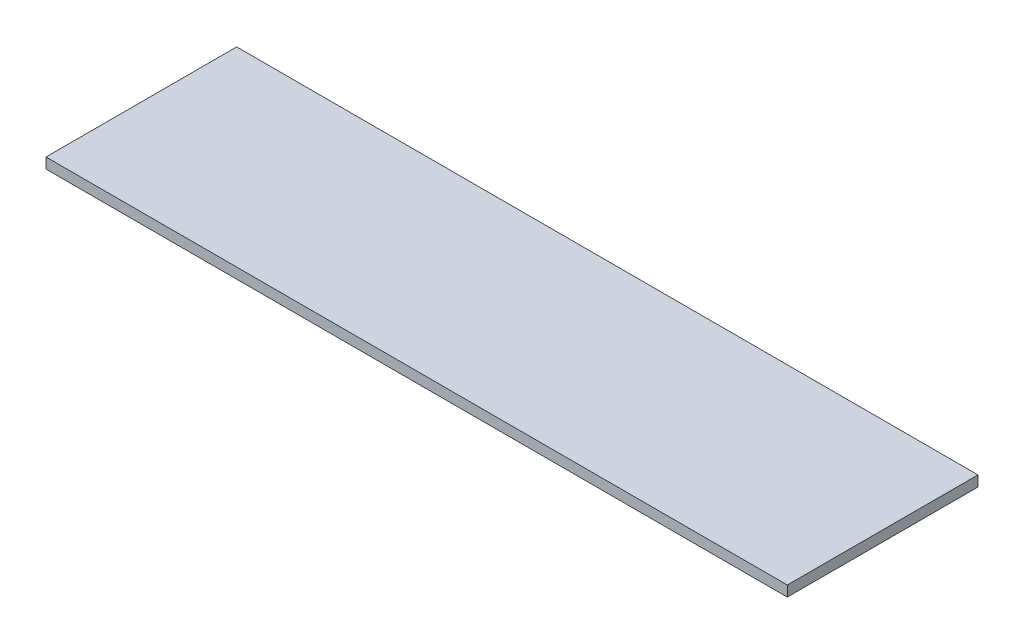
ISO-10303-21;
HEADER;
FILE_DESCRIPTION(('STEP AP214'),'2;1');
FILE_NAME('part.step','',(''),(''),'','','');
FILE_SCHEMA(('AUTOMOTIVE_DESIGN { 1 0 10303 214 1 1 1 1 }'));
ENDSEC;
DATA;
#1=APPLICATION_CONTEXT('core data for automotive mechanical design processes');
#2=APPLICATION_PROTOCOL_DEFINITION('international standard','automotive_design',2000,#1);
#3=PRODUCT_CONTEXT('',#1,'mechanical');
#4=PRODUCT('Part','Part','',(#3));
#5=PRODUCT_RELATED_PRODUCT_CATEGORY('part','',(#4));
#6=PRODUCT_DEFINITION_FORMATION('','',#4);
#7=PRODUCT_DEFINITION_CONTEXT('part definition',#1,'design');
#8=PRODUCT_DEFINITION('design','',#6,#7);
#9=PRODUCT_DEFINITION_SHAPE('','',#8);
#10=(LENGTH_UNIT() NAMED_UNIT(*) SI_UNIT(.MILLI.,.METRE.));
#11=(NAMED_UNIT(*) PLANE_ANGLE_UNIT() SI_UNIT($,.RADIAN.));
#12=(NAMED_UNIT(*) SI_UNIT($,.STERADIAN.) SOLID_ANGLE_UNIT());
#13=UNCERTAINTY_MEASURE_WITH_UNIT(LENGTH_MEASURE(1.E-05),#10,'distance_accuracy_value','');
#14=(GEOMETRIC_REPRESENTATION_CONTEXT(3) GLOBAL_UNCERTAINTY_ASSIGNED_CONTEXT((#13)) GLOBAL_UNIT_ASSIGNED_CONTEXT((#10,
#11,#12)) REPRESENTATION_CONTEXT('',''));
#15=CARTESIAN_POINT('',(0.,0.,0.));
#16=DIRECTION('',(0.,0.,1.));
#17=DIRECTION('',(1.,0.,0.));
#18=AXIS2_PLACEMENT_3D('',#15,#16,#17);
#19=CARTESIAN_POINT('',(0.,2.,-36.3076427679414));
#20=DIRECTION('',(1.,0.,0.));
#21=DIRECTION('',(0.,0.,-1.));
#22=AXIS2_PLACEMENT_3D('',#19,#20,#21);
#23=PLANE('',#22);
#24=DIRECTION('',(0.,0.,1.));
#25=VECTOR('',#24,1.);
#26=CARTESIAN_POINT('',(0.,0.,-36.3076427679414));
#27=LINE('',#26,#25);
#28=CARTESIAN_POINT('',(0.,0.,-36.3076427679414));
#29=VERTEX_POINT('',#28);
#30=CARTESIAN_POINT('',(0.,0.,0.));
#31=VERTEX_POINT('',#30);
#32=EDGE_CURVE('E107',#29,#31,#27,.T.);
#33=ORIENTED_EDGE('',*,*,#32,.T.);
#34=DIRECTION('',(0.,-1.,0.));
#35=VECTOR('',#34,1.);
#36=CARTESIAN_POINT('',(0.,2.,0.));
#37=LINE('',#36,#35);
#38=CARTESIAN_POINT('',(0.,2.,0.));
#39=VERTEX_POINT('',#38);
#40=EDGE_CURVE('E11',#39,#31,#37,.T.);
#41=ORIENTED_EDGE('',*,*,#40,.F.);
#42=DIRECTION('',(0.,0.,1.));
#43=VECTOR('',#42,1.);
#44=CARTESIAN_POINT('',(0.,2.,-36.3076427679414));
#45=LINE('',#44,#43);
#46=CARTESIAN_POINT('',(0.,2.,-36.3076427679414));
#47=VERTEX_POINT('',#46);
#48=EDGE_CURVE('E91',#47,#39,#45,.T.);
#49=ORIENTED_EDGE('',*,*,#48,.F.);
#50=DIRECTION('',(0.,-1.,0.));
#51=VECTOR('',#50,1.);
#52=CARTESIAN_POINT('',(0.,2.,-36.3076427679414));
#53=LINE('',#52,#51);
#54=EDGE_CURVE('E103',#47,#29,#53,.T.);
#55=ORIENTED_EDGE('',*,*,#54,.T.);
#56=EDGE_LOOP('',(#33,#41,#49,#55));
#57=FACE_BOUND('',#56,.T.);
#58=ADVANCED_FACE('F39',(#57),#23,.F.);
#59=CARTESIAN_POINT('',(0.,2.,0.));
#60=DIRECTION('',(0.,0.,-1.));
#61=DIRECTION('',(-1.,0.,0.));
#62=AXIS2_PLACEMENT_3D('',#59,#60,#61);
#63=PLANE('',#62);
#64=DIRECTION('',(1.,0.,0.));
#65=VECTOR('',#64,1.);
#66=CARTESIAN_POINT('',(0.,0.,0.));
#67=LINE('',#66,#65);
#68=CARTESIAN_POINT('',(141.16131970371,0.,0.));
#69=VERTEX_POINT('',#68);
#70=EDGE_CURVE('E96',#31,#69,#67,.T.);
#71=ORIENTED_EDGE('',*,*,#70,.T.);
#72=DIRECTION('',(0.,-1.,0.));
#73=VECTOR('',#72,1.);
#74=CARTESIAN_POINT('',(141.16131970371,2.,0.));
#75=LINE('',#74,#73);
#76=CARTESIAN_POINT('',(141.16131970371,2.,0.));
#77=VERTEX_POINT('',#76);
#78=EDGE_CURVE('E48',#77,#69,#75,.T.);
#79=ORIENTED_EDGE('',*,*,#78,.F.);
#80=DIRECTION('',(1.,0.,0.));
#81=VECTOR('',#80,1.);
#82=CARTESIAN_POINT('',(0.,2.,0.));
#83=LINE('',#82,#81);
#84=EDGE_CURVE('E86',#39,#77,#83,.T.);
#85=ORIENTED_EDGE('',*,*,#84,.F.);
#86=ORIENTED_EDGE('',*,*,#40,.T.);
#87=EDGE_LOOP('',(#71,#79,#85,#86));
#88=FACE_BOUND('',#87,.T.);
#89=ADVANCED_FACE('F95',(#88),#63,.F.);
#90=CARTESIAN_POINT('',(141.16131970371,2.,0.));
#91=DIRECTION('',(-1.,0.,0.));
#92=DIRECTION('',(0.,0.,1.));
#93=AXIS2_PLACEMENT_3D('',#90,#91,#92);
#94=PLANE('',#93);
#95=DIRECTION('',(0.,0.,-1.));
#96=VECTOR('',#95,1.);
#97=CARTESIAN_POINT('',(141.16131970371,0.,0.));
#98=LINE('',#97,#96);
#99=CARTESIAN_POINT('',(141.16131970371,0.,-36.3076427679414));
#100=VERTEX_POINT('',#99);
#101=EDGE_CURVE('E73',#69,#100,#98,.T.);
#102=ORIENTED_EDGE('',*,*,#101,.T.);
#103=DIRECTION('',(0.,-1.,0.));
#104=VECTOR('',#103,1.);
#105=CARTESIAN_POINT('',(141.16131970371,2.,-36.3076427679414));
#106=LINE('',#105,#104);
#107=CARTESIAN_POINT('',(141.16131970371,2.,-36.3076427679414));
#108=VERTEX_POINT('',#107);
#109=EDGE_CURVE('E98',#108,#100,#106,.T.);
#110=ORIENTED_EDGE('',*,*,#109,.F.);
#111=DIRECTION('',(0.,0.,-1.));
#112=VECTOR('',#111,1.);
#113=CARTESIAN_POINT('',(141.16131970371,2.,0.));
#114=LINE('',#113,#112);
#115=EDGE_CURVE('E89',#77,#108,#114,.T.);
#116=ORIENTED_EDGE('',*,*,#115,.F.);
#117=ORIENTED_EDGE('',*,*,#78,.T.);
#118=EDGE_LOOP('',(#102,#110,#116,#117));
#119=FACE_BOUND('',#118,.T.);
#120=ADVANCED_FACE('F99',(#119),#94,.F.);
#121=CARTESIAN_POINT('',(141.16131970371,2.,-36.3076427679414));
#122=DIRECTION('',(0.,0.,1.));
#123=DIRECTION('',(1.,0.,0.));
#124=AXIS2_PLACEMENT_3D('',#121,#122,#123);
#125=PLANE('',#124);
#126=DIRECTION('',(-1.,0.,0.));
#127=VECTOR('',#126,1.);
#128=CARTESIAN_POINT('',(141.16131970371,0.,-36.3076427679414));
#129=LINE('',#128,#127);
#130=EDGE_CURVE('E79',#100,#29,#129,.T.);
#131=ORIENTED_EDGE('',*,*,#130,.T.);
#132=ORIENTED_EDGE('',*,*,#54,.F.);
#133=DIRECTION('',(-1.,0.,0.));
#134=VECTOR('',#133,1.);
#135=CARTESIAN_POINT('',(141.16131970371,2.,-36.3076427679414));
#136=LINE('',#135,#134);
#137=EDGE_CURVE('E56',#108,#47,#136,.T.);
#138=ORIENTED_EDGE('',*,*,#137,.F.);
#139=ORIENTED_EDGE('',*,*,#109,.T.);
#140=EDGE_LOOP('',(#131,#132,#138,#139));
#141=FACE_BOUND('',#140,.T.);
#142=ADVANCED_FACE('F120',(#141),#125,.F.);
#143=CARTESIAN_POINT('',(0.,2.,0.));
#144=DIRECTION('',(0.,1.,0.));
#145=DIRECTION('',(0.,0.,1.));
#146=AXIS2_PLACEMENT_3D('',#143,#144,#145);
#147=PLANE('',#146);
#148=ORIENTED_EDGE('',*,*,#48,.T.);
#149=ORIENTED_EDGE('',*,*,#84,.T.);
#150=ORIENTED_EDGE('',*,*,#115,.T.);
#151=ORIENTED_EDGE('',*,*,#137,.T.);
#152=EDGE_LOOP('',(#148,#149,#150,#151));
#153=FACE_BOUND('',#152,.T.);
#154=ADVANCED_FACE('F87',(#153),#147,.T.);
#155=CARTESIAN_POINT('',(0.,0.,0.));
#156=DIRECTION('',(0.,1.,0.));
#157=DIRECTION('',(0.,0.,1.));
#158=AXIS2_PLACEMENT_3D('',#155,#156,#157);
#159=PLANE('',#158);
#160=ORIENTED_EDGE('',*,*,#32,.F.);
#161=ORIENTED_EDGE('',*,*,#130,.F.);
#162=ORIENTED_EDGE('',*,*,#101,.F.);
#163=ORIENTED_EDGE('',*,*,#70,.F.);
#164=EDGE_LOOP('',(#160,#161,#162,#163));
#165=FACE_BOUND('',#164,.T.);
#166=ADVANCED_FACE('F123',(#165),#159,.F.);
#167=CLOSED_SHELL('',(#58,#89,#120,#142,#154,#166));
#168=MANIFOLD_SOLID_BREP('B2',#167);
#169=ADVANCED_BREP_SHAPE_REPRESENTATION('',(#18,#168),#14);
#170=SHAPE_DEFINITION_REPRESENTATION(#9,#169);
ENDSEC;
END-ISO-10303-21;
